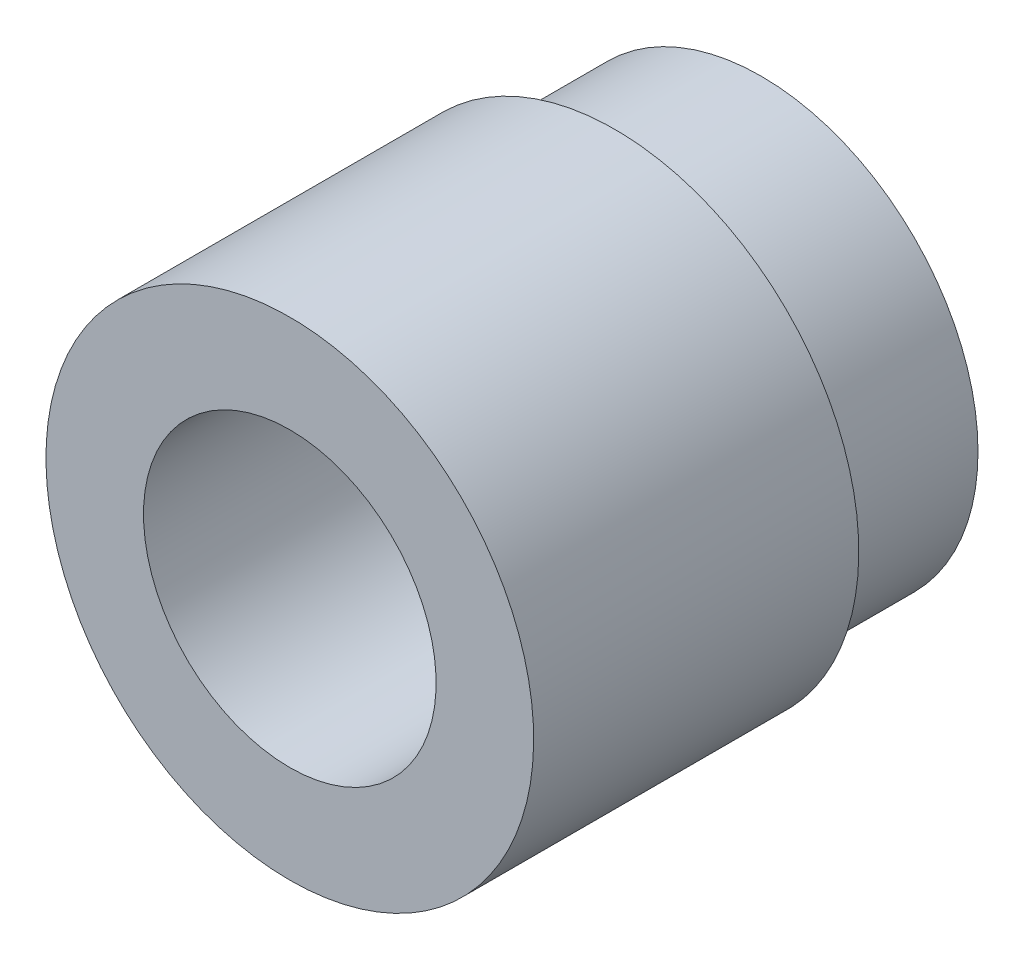
ISO-10303-21;
HEADER;
FILE_DESCRIPTION(('STEP AP214'),'2;1');
FILE_NAME('part.step','',(''),(''),'','','');
FILE_SCHEMA(('AUTOMOTIVE_DESIGN { 1 0 10303 214 1 1 1 1 }'));
ENDSEC;
DATA;
#1=APPLICATION_CONTEXT('core data for automotive mechanical design processes');
#2=APPLICATION_PROTOCOL_DEFINITION('international standard','automotive_design',2000,#1);
#3=PRODUCT_CONTEXT('',#1,'mechanical');
#4=PRODUCT('Part','Part','',(#3));
#5=PRODUCT_RELATED_PRODUCT_CATEGORY('part','',(#4));
#6=PRODUCT_DEFINITION_FORMATION('','',#4);
#7=PRODUCT_DEFINITION_CONTEXT('part definition',#1,'design');
#8=PRODUCT_DEFINITION('design','',#6,#7);
#9=PRODUCT_DEFINITION_SHAPE('','',#8);
#10=(LENGTH_UNIT() NAMED_UNIT(*) SI_UNIT(.MILLI.,.METRE.));
#11=(NAMED_UNIT(*) PLANE_ANGLE_UNIT() SI_UNIT($,.RADIAN.));
#12=(NAMED_UNIT(*) SI_UNIT($,.STERADIAN.) SOLID_ANGLE_UNIT());
#13=UNCERTAINTY_MEASURE_WITH_UNIT(LENGTH_MEASURE(1.E-05),#10,'distance_accuracy_value','');
#14=(GEOMETRIC_REPRESENTATION_CONTEXT(3) GLOBAL_UNCERTAINTY_ASSIGNED_CONTEXT((#13)) GLOBAL_UNIT_ASSIGNED_CONTEXT((#10,
#11,#12)) REPRESENTATION_CONTEXT('',''));
#15=CARTESIAN_POINT('',(0.,0.,0.));
#16=DIRECTION('',(0.,0.,1.));
#17=DIRECTION('',(1.,0.,0.));
#18=AXIS2_PLACEMENT_3D('',#15,#16,#17);
#19=CARTESIAN_POINT('',(0.,0.,-48.9449652892562));
#20=DIRECTION('',(0.,0.,1.));
#21=DIRECTION('',(1.,0.,0.));
#22=AXIS2_PLACEMENT_3D('',#19,#20,#21);
#23=CONICAL_SURFACE('',#22,20.,1.13087408459218);
#24=CARTESIAN_POINT('',(0.,0.,-48.9449652892562));
#25=DIRECTION('',(0.,0.,1.));
#26=DIRECTION('',(0.,-1.,0.));
#27=AXIS2_PLACEMENT_3D('',#24,#25,#26);
#28=CIRCLE('',#27,20.);
#29=CARTESIAN_POINT('',(0.,-20.,-48.9449652892562));
#30=VERTEX_POINT('',#29);
#31=EDGE_CURVE('E29',#30,#30,#28,.T.);
#32=ORIENTED_EDGE('',*,*,#31,.F.);
#33=EDGE_LOOP('',(#32));
#34=FACE_BOUND('',#33,.T.);
#35=CARTESIAN_POINT('',(0.,0.,-50.4449652892562));
#36=DIRECTION('',(0.,0.,1.));
#37=DIRECTION('',(1.,0.,0.));
#38=AXIS2_PLACEMENT_3D('',#35,#36,#37);
#39=CIRCLE('',#38,16.8131589454171);
#40=CARTESIAN_POINT('',(16.8131589454171,0.,-50.4449652892562));
#41=VERTEX_POINT('',#40);
#42=EDGE_CURVE('E17',#41,#41,#39,.T.);
#43=ORIENTED_EDGE('',*,*,#42,.T.);
#44=EDGE_LOOP('',(#43));
#45=FACE_BOUND('',#44,.T.);
#46=ADVANCED_FACE('F14',(#34,#45),#23,.T.);
#47=CARTESIAN_POINT('',(0.,0.,-5.44496528925618));
#48=DIRECTION('',(0.,0.,1.));
#49=DIRECTION('',(0.,-1.,0.));
#50=AXIS2_PLACEMENT_3D('',#47,#48,#49);
#51=CYLINDRICAL_SURFACE('',#50,20.);
#52=ORIENTED_EDGE('',*,*,#31,.T.);
#53=EDGE_LOOP('',(#52));
#54=FACE_BOUND('',#53,.T.);
#55=CARTESIAN_POINT('',(0.,0.,-36.9449652892562));
#56=DIRECTION('',(0.,0.,-1.));
#57=DIRECTION('',(0.,1.,0.));
#58=AXIS2_PLACEMENT_3D('',#55,#56,#57);
#59=CIRCLE('',#58,20.);
#60=CARTESIAN_POINT('',(0.,20.,-36.9449652892562));
#61=VERTEX_POINT('',#60);
#62=EDGE_CURVE('E38',#61,#61,#59,.F.);
#63=ORIENTED_EDGE('',*,*,#62,.F.);
#64=EDGE_LOOP('',(#63));
#65=FACE_BOUND('',#64,.T.);
#66=ADVANCED_FACE('F50',(#54,#65),#51,.T.);
#67=CARTESIAN_POINT('',(0.,16.8131589454171,-50.4449652892562));
#68=DIRECTION('',(0.,0.,1.));
#69=DIRECTION('',(0.,-1.,0.));
#70=AXIS2_PLACEMENT_3D('',#67,#68,#69);
#71=PLANE('',#70);
#72=CARTESIAN_POINT('',(0.,0.,-50.4449652892562));
#73=DIRECTION('',(0.,0.,1.));
#74=DIRECTION('',(0.,-1.,0.));
#75=AXIS2_PLACEMENT_3D('',#72,#73,#74);
#76=CIRCLE('',#75,13.5);
#77=CARTESIAN_POINT('',(0.,-13.5,-50.4449652892562));
#78=VERTEX_POINT('',#77);
#79=EDGE_CURVE('E36',#78,#78,#76,.T.);
#80=ORIENTED_EDGE('',*,*,#79,.T.);
#81=EDGE_LOOP('',(#80));
#82=FACE_BOUND('',#81,.T.);
#83=ORIENTED_EDGE('',*,*,#42,.F.);
#84=EDGE_LOOP('',(#83));
#85=FACE_BOUND('',#84,.T.);
#86=ADVANCED_FACE('F58',(#82,#85),#71,.F.);
#87=CARTESIAN_POINT('',(0.,0.,-36.9449652892562));
#88=DIRECTION('',(0.,0.,-1.));
#89=DIRECTION('',(-1.,0.,0.));
#90=AXIS2_PLACEMENT_3D('',#87,#88,#89);
#91=CONICAL_SURFACE('',#90,20.,0.785398163397447);
#92=CARTESIAN_POINT('',(0.,0.,-35.4449652892562));
#93=DIRECTION('',(0.,0.,-1.));
#94=DIRECTION('',(-1.,0.,0.));
#95=AXIS2_PLACEMENT_3D('',#92,#93,#94);
#96=CIRCLE('',#95,18.5);
#97=CARTESIAN_POINT('',(-18.5,0.,-35.4449652892562));
#98=VERTEX_POINT('',#97);
#99=EDGE_CURVE('E34',#98,#98,#96,.T.);
#100=ORIENTED_EDGE('',*,*,#99,.T.);
#101=EDGE_LOOP('',(#100));
#102=FACE_BOUND('',#101,.T.);
#103=ORIENTED_EDGE('',*,*,#62,.T.);
#104=EDGE_LOOP('',(#103));
#105=FACE_BOUND('',#104,.T.);
#106=ADVANCED_FACE('F77',(#102,#105),#91,.T.);
#107=CARTESIAN_POINT('',(0.,0.,-5.44496528925618));
#108=DIRECTION('',(0.,0.,1.));
#109=DIRECTION('',(0.,-1.,0.));
#110=AXIS2_PLACEMENT_3D('',#107,#108,#109);
#111=CYLINDRICAL_SURFACE('',#110,13.5);
#112=ORIENTED_EDGE('',*,*,#79,.F.);
#113=EDGE_LOOP('',(#112));
#114=FACE_BOUND('',#113,.T.);
#115=CARTESIAN_POINT('',(0.,0.,-5.44496528925618));
#116=DIRECTION('',(0.,0.,1.));
#117=DIRECTION('',(0.,-1.,0.));
#118=AXIS2_PLACEMENT_3D('',#115,#116,#117);
#119=CIRCLE('',#118,13.5);
#120=CARTESIAN_POINT('',(0.,-13.5,-5.44496528925618));
#121=VERTEX_POINT('',#120);
#122=EDGE_CURVE('E26',#121,#121,#119,.T.);
#123=ORIENTED_EDGE('',*,*,#122,.T.);
#124=EDGE_LOOP('',(#123));
#125=FACE_BOUND('',#124,.T.);
#126=ADVANCED_FACE('F73',(#114,#125),#111,.F.);
#127=CARTESIAN_POINT('',(0.,22.5,-35.4449652892562));
#128=DIRECTION('',(0.,0.,1.));
#129=DIRECTION('',(0.,-1.,0.));
#130=AXIS2_PLACEMENT_3D('',#127,#128,#129);
#131=PLANE('',#130);
#132=ORIENTED_EDGE('',*,*,#99,.F.);
#133=EDGE_LOOP('',(#132));
#134=FACE_BOUND('',#133,.T.);
#135=CARTESIAN_POINT('',(0.,0.,-35.4449652892562));
#136=DIRECTION('',(0.,0.,1.));
#137=DIRECTION('',(0.,-1.,0.));
#138=AXIS2_PLACEMENT_3D('',#135,#136,#137);
#139=CIRCLE('',#138,22.5);
#140=CARTESIAN_POINT('',(0.,-22.5,-35.4449652892562));
#141=VERTEX_POINT('',#140);
#142=EDGE_CURVE('E21',#141,#141,#139,.T.);
#143=ORIENTED_EDGE('',*,*,#142,.F.);
#144=EDGE_LOOP('',(#143));
#145=FACE_BOUND('',#144,.T.);
#146=ADVANCED_FACE('F66',(#134,#145),#131,.F.);
#147=CARTESIAN_POINT('',(0.,13.5,-5.44496528925618));
#148=DIRECTION('',(0.,0.,-1.));
#149=DIRECTION('',(0.,1.,0.));
#150=AXIS2_PLACEMENT_3D('',#147,#148,#149);
#151=PLANE('',#150);
#152=CARTESIAN_POINT('',(0.,0.,-5.44496528925618));
#153=DIRECTION('',(0.,0.,1.));
#154=DIRECTION('',(0.,-1.,0.));
#155=AXIS2_PLACEMENT_3D('',#152,#153,#154);
#156=CIRCLE('',#155,22.5);
#157=CARTESIAN_POINT('',(0.,-22.5,-5.44496528925618));
#158=VERTEX_POINT('',#157);
#159=EDGE_CURVE('E10',#158,#158,#156,.F.);
#160=ORIENTED_EDGE('',*,*,#159,.F.);
#161=EDGE_LOOP('',(#160));
#162=FACE_BOUND('',#161,.T.);
#163=ORIENTED_EDGE('',*,*,#122,.F.);
#164=EDGE_LOOP('',(#163));
#165=FACE_BOUND('',#164,.T.);
#166=ADVANCED_FACE('F61',(#162,#165),#151,.F.);
#167=CARTESIAN_POINT('',(0.,0.,-5.44496528925618));
#168=DIRECTION('',(0.,0.,1.));
#169=DIRECTION('',(0.,-1.,0.));
#170=AXIS2_PLACEMENT_3D('',#167,#168,#169);
#171=CYLINDRICAL_SURFACE('',#170,22.5);
#172=ORIENTED_EDGE('',*,*,#159,.T.);
#173=EDGE_LOOP('',(#172));
#174=FACE_BOUND('',#173,.T.);
#175=ORIENTED_EDGE('',*,*,#142,.T.);
#176=EDGE_LOOP('',(#175));
#177=FACE_BOUND('',#176,.T.);
#178=ADVANCED_FACE('F59',(#174,#177),#171,.T.);
#179=CLOSED_SHELL('',(#46,#66,#86,#106,#126,#146,#166,#178));
#180=MANIFOLD_SOLID_BREP('B1',#179);
#181=ADVANCED_BREP_SHAPE_REPRESENTATION('',(#18,#180),#14);
#182=SHAPE_DEFINITION_REPRESENTATION(#9,#181);
ENDSEC;
END-ISO-10303-21;
